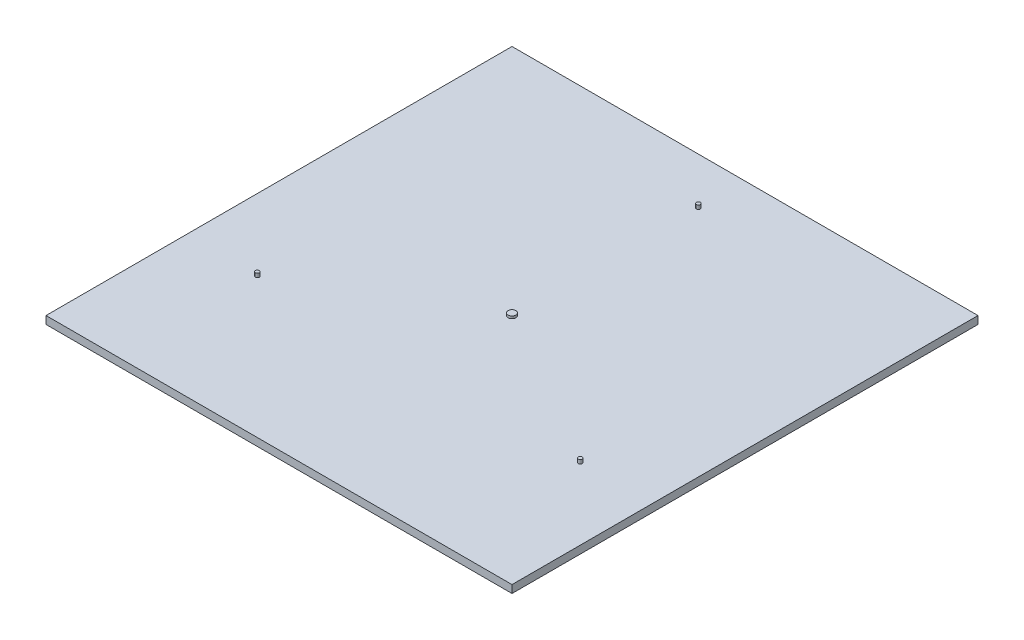
ISO-10303-21;
HEADER;
FILE_DESCRIPTION(('STEP AP214'),'2;1');
FILE_NAME('part.step','',(''),(''),'','','');
FILE_SCHEMA(('AUTOMOTIVE_DESIGN { 1 0 10303 214 1 1 1 1 }'));
ENDSEC;
DATA;
#1=APPLICATION_CONTEXT('core data for automotive mechanical design processes');
#2=APPLICATION_PROTOCOL_DEFINITION('international standard','automotive_design',2000,#1);
#3=PRODUCT_CONTEXT('',#1,'mechanical');
#4=PRODUCT('Part','Part','',(#3));
#5=PRODUCT_RELATED_PRODUCT_CATEGORY('part','',(#4));
#6=PRODUCT_DEFINITION_FORMATION('','',#4);
#7=PRODUCT_DEFINITION_CONTEXT('part definition',#1,'design');
#8=PRODUCT_DEFINITION('design','',#6,#7);
#9=PRODUCT_DEFINITION_SHAPE('','',#8);
#10=(LENGTH_UNIT() NAMED_UNIT(*) SI_UNIT(.MILLI.,.METRE.));
#11=(NAMED_UNIT(*) PLANE_ANGLE_UNIT() SI_UNIT($,.RADIAN.));
#12=(NAMED_UNIT(*) SI_UNIT($,.STERADIAN.) SOLID_ANGLE_UNIT());
#13=UNCERTAINTY_MEASURE_WITH_UNIT(LENGTH_MEASURE(1.E-05),#10,'distance_accuracy_value','');
#14=(GEOMETRIC_REPRESENTATION_CONTEXT(3) GLOBAL_UNCERTAINTY_ASSIGNED_CONTEXT((#13)) GLOBAL_UNIT_ASSIGNED_CONTEXT((#10,
#11,#12)) REPRESENTATION_CONTEXT('',''));
#15=CARTESIAN_POINT('',(0.,0.,0.));
#16=DIRECTION('',(0.,0.,1.));
#17=DIRECTION('',(1.,0.,0.));
#18=AXIS2_PLACEMENT_3D('',#15,#16,#17);
#19=CARTESIAN_POINT('',(-300.,10.,-300.));
#20=DIRECTION('',(1.,0.,0.));
#21=DIRECTION('',(0.,0.,-1.));
#22=AXIS2_PLACEMENT_3D('',#19,#20,#21);
#23=PLANE('',#22);
#24=DIRECTION('',(0.,0.,1.));
#25=VECTOR('',#24,1.);
#26=CARTESIAN_POINT('',(-300.,0.,-300.));
#27=LINE('',#26,#25);
#28=CARTESIAN_POINT('',(-300.,0.,-300.));
#29=VERTEX_POINT('',#28);
#30=CARTESIAN_POINT('',(-300.,0.,300.));
#31=VERTEX_POINT('',#30);
#32=EDGE_CURVE('E107',#29,#31,#27,.T.);
#33=ORIENTED_EDGE('',*,*,#32,.T.);
#34=DIRECTION('',(0.,-1.,0.));
#35=VECTOR('',#34,1.);
#36=CARTESIAN_POINT('',(-300.,10.,300.));
#37=LINE('',#36,#35);
#38=CARTESIAN_POINT('',(-300.,10.,300.));
#39=VERTEX_POINT('',#38);
#40=EDGE_CURVE('E11',#39,#31,#37,.T.);
#41=ORIENTED_EDGE('',*,*,#40,.F.);
#42=DIRECTION('',(0.,0.,1.));
#43=VECTOR('',#42,1.);
#44=CARTESIAN_POINT('',(-300.,10.,-300.));
#45=LINE('',#44,#43);
#46=CARTESIAN_POINT('',(-300.,10.,-300.));
#47=VERTEX_POINT('',#46);
#48=EDGE_CURVE('E91',#47,#39,#45,.T.);
#49=ORIENTED_EDGE('',*,*,#48,.F.);
#50=DIRECTION('',(0.,-1.,0.));
#51=VECTOR('',#50,1.);
#52=CARTESIAN_POINT('',(-300.,10.,-300.));
#53=LINE('',#52,#51);
#54=EDGE_CURVE('E103',#47,#29,#53,.T.);
#55=ORIENTED_EDGE('',*,*,#54,.T.);
#56=EDGE_LOOP('',(#33,#41,#49,#55));
#57=FACE_BOUND('',#56,.T.);
#58=ADVANCED_FACE('F39',(#57),#23,.F.);
#59=CARTESIAN_POINT('',(-300.,10.,300.));
#60=DIRECTION('',(0.,0.,-1.));
#61=DIRECTION('',(-1.,0.,0.));
#62=AXIS2_PLACEMENT_3D('',#59,#60,#61);
#63=PLANE('',#62);
#64=DIRECTION('',(1.,0.,0.));
#65=VECTOR('',#64,1.);
#66=CARTESIAN_POINT('',(-300.,0.,300.));
#67=LINE('',#66,#65);
#68=CARTESIAN_POINT('',(300.,0.,300.));
#69=VERTEX_POINT('',#68);
#70=EDGE_CURVE('E96',#31,#69,#67,.T.);
#71=ORIENTED_EDGE('',*,*,#70,.T.);
#72=DIRECTION('',(0.,-1.,0.));
#73=VECTOR('',#72,1.);
#74=CARTESIAN_POINT('',(300.,10.,300.));
#75=LINE('',#74,#73);
#76=CARTESIAN_POINT('',(300.,10.,300.));
#77=VERTEX_POINT('',#76);
#78=EDGE_CURVE('E48',#77,#69,#75,.T.);
#79=ORIENTED_EDGE('',*,*,#78,.F.);
#80=DIRECTION('',(1.,0.,0.));
#81=VECTOR('',#80,1.);
#82=CARTESIAN_POINT('',(-300.,10.,300.));
#83=LINE('',#82,#81);
#84=EDGE_CURVE('E86',#39,#77,#83,.T.);
#85=ORIENTED_EDGE('',*,*,#84,.F.);
#86=ORIENTED_EDGE('',*,*,#40,.T.);
#87=EDGE_LOOP('',(#71,#79,#85,#86));
#88=FACE_BOUND('',#87,.T.);
#89=ADVANCED_FACE('F95',(#88),#63,.F.);
#90=CARTESIAN_POINT('',(300.,10.,-300.));
#91=DIRECTION('',(-1.,0.,0.));
#92=DIRECTION('',(0.,0.,1.));
#93=AXIS2_PLACEMENT_3D('',#90,#91,#92);
#94=PLANE('',#93);
#95=DIRECTION('',(0.,0.,-1.));
#96=VECTOR('',#95,1.);
#97=CARTESIAN_POINT('',(300.,0.,-300.));
#98=LINE('',#97,#96);
#99=CARTESIAN_POINT('',(300.,0.,-300.));
#100=VERTEX_POINT('',#99);
#101=EDGE_CURVE('E73',#69,#100,#98,.T.);
#102=ORIENTED_EDGE('',*,*,#101,.T.);
#103=DIRECTION('',(0.,-1.,0.));
#104=VECTOR('',#103,1.);
#105=CARTESIAN_POINT('',(300.,10.,-300.));
#106=LINE('',#105,#104);
#107=CARTESIAN_POINT('',(300.,10.,-300.));
#108=VERTEX_POINT('',#107);
#109=EDGE_CURVE('E98',#108,#100,#106,.T.);
#110=ORIENTED_EDGE('',*,*,#109,.F.);
#111=DIRECTION('',(0.,0.,-1.));
#112=VECTOR('',#111,1.);
#113=CARTESIAN_POINT('',(300.,10.,-300.));
#114=LINE('',#113,#112);
#115=EDGE_CURVE('E89',#77,#108,#114,.T.);
#116=ORIENTED_EDGE('',*,*,#115,.F.);
#117=ORIENTED_EDGE('',*,*,#78,.T.);
#118=EDGE_LOOP('',(#102,#110,#116,#117));
#119=FACE_BOUND('',#118,.T.);
#120=ADVANCED_FACE('F99',(#119),#94,.F.);
#121=CARTESIAN_POINT('',(-300.,10.,-300.));
#122=DIRECTION('',(0.,0.,1.));
#123=DIRECTION('',(1.,0.,0.));
#124=AXIS2_PLACEMENT_3D('',#121,#122,#123);
#125=PLANE('',#124);
#126=DIRECTION('',(-1.,0.,0.));
#127=VECTOR('',#126,1.);
#128=CARTESIAN_POINT('',(-300.,0.,-300.));
#129=LINE('',#128,#127);
#130=EDGE_CURVE('E79',#100,#29,#129,.T.);
#131=ORIENTED_EDGE('',*,*,#130,.T.);
#132=ORIENTED_EDGE('',*,*,#54,.F.);
#133=DIRECTION('',(-1.,0.,0.));
#134=VECTOR('',#133,1.);
#135=CARTESIAN_POINT('',(-300.,10.,-300.));
#136=LINE('',#135,#134);
#137=EDGE_CURVE('E56',#108,#47,#136,.T.);
#138=ORIENTED_EDGE('',*,*,#137,.F.);
#139=ORIENTED_EDGE('',*,*,#109,.T.);
#140=EDGE_LOOP('',(#131,#132,#138,#139));
#141=FACE_BOUND('',#140,.T.);
#142=ADVANCED_FACE('F121',(#141),#125,.F.);
#143=CARTESIAN_POINT('',(0.,10.,0.));
#144=DIRECTION('',(0.,1.,0.));
#145=DIRECTION('',(0.,0.,1.));
#146=AXIS2_PLACEMENT_3D('',#143,#144,#145);
#147=PLANE('',#146);
#148=CARTESIAN_POINT('',(0.,10.,0.));
#149=DIRECTION('',(0.,1.,0.));
#150=DIRECTION('',(0.,0.,1.));
#151=AXIS2_PLACEMENT_3D('',#148,#149,#150);
#152=CIRCLE('',#151,5.);
#153=CARTESIAN_POINT('',(0.,10.,5.));
#154=VERTEX_POINT('',#153);
#155=EDGE_CURVE('E152',#154,#154,#152,.T.);
#156=ORIENTED_EDGE('',*,*,#155,.F.);
#157=EDGE_LOOP('',(#156));
#158=FACE_BOUND('',#157,.T.);
#159=CARTESIAN_POINT('',(-207.846096908265,10.,120.000000000001));
#160=DIRECTION('',(0.,1.,0.));
#161=DIRECTION('',(0.,0.,1.));
#162=AXIS2_PLACEMENT_3D('',#159,#160,#161);
#163=CIRCLE('',#162,2.5);
#164=CARTESIAN_POINT('',(-207.846096908265,10.,122.500000000001));
#165=VERTEX_POINT('',#164);
#166=EDGE_CURVE('E144',#165,#165,#163,.T.);
#167=ORIENTED_EDGE('',*,*,#166,.F.);
#168=EDGE_LOOP('',(#167));
#169=FACE_BOUND('',#168,.T.);
#170=CARTESIAN_POINT('',(207.846096908266,10.,119.999999999998));
#171=DIRECTION('',(0.,1.,0.));
#172=DIRECTION('',(0.,0.,1.));
#173=AXIS2_PLACEMENT_3D('',#170,#171,#172);
#174=CIRCLE('',#173,2.50000000000005);
#175=CARTESIAN_POINT('',(207.846096908266,10.,122.499999999998));
#176=VERTEX_POINT('',#175);
#177=EDGE_CURVE('E136',#176,#176,#174,.T.);
#178=ORIENTED_EDGE('',*,*,#177,.F.);
#179=EDGE_LOOP('',(#178));
#180=FACE_BOUND('',#179,.T.);
#181=CARTESIAN_POINT('',(0.,10.,-240.));
#182=DIRECTION('',(0.,1.,0.));
#183=DIRECTION('',(0.,0.,1.));
#184=AXIS2_PLACEMENT_3D('',#181,#182,#183);
#185=CIRCLE('',#184,2.5);
#186=CARTESIAN_POINT('',(0.,10.,-237.5));
#187=VERTEX_POINT('',#186);
#188=EDGE_CURVE('E128',#187,#187,#185,.T.);
#189=ORIENTED_EDGE('',*,*,#188,.F.);
#190=EDGE_LOOP('',(#189));
#191=FACE_BOUND('',#190,.T.);
#192=ORIENTED_EDGE('',*,*,#48,.T.);
#193=ORIENTED_EDGE('',*,*,#84,.T.);
#194=ORIENTED_EDGE('',*,*,#115,.T.);
#195=ORIENTED_EDGE('',*,*,#137,.T.);
#196=EDGE_LOOP('',(#192,#193,#194,#195));
#197=FACE_BOUND('',#196,.T.);
#198=ADVANCED_FACE('F87',(#158,#169,#180,#191,#197),#147,.T.);
#199=CARTESIAN_POINT('',(0.,0.,0.));
#200=DIRECTION('',(0.,1.,0.));
#201=DIRECTION('',(0.,0.,1.));
#202=AXIS2_PLACEMENT_3D('',#199,#200,#201);
#203=PLANE('',#202);
#204=ORIENTED_EDGE('',*,*,#32,.F.);
#205=ORIENTED_EDGE('',*,*,#130,.F.);
#206=ORIENTED_EDGE('',*,*,#101,.F.);
#207=ORIENTED_EDGE('',*,*,#70,.F.);
#208=EDGE_LOOP('',(#204,#205,#206,#207));
#209=FACE_BOUND('',#208,.T.);
#210=ADVANCED_FACE('F124',(#209),#203,.F.);
#211=CARTESIAN_POINT('',(0.,15.,-240.));
#212=DIRECTION('',(0.,-1.,0.));
#213=DIRECTION('',(0.,0.,-1.));
#214=AXIS2_PLACEMENT_3D('',#211,#212,#213);
#215=CYLINDRICAL_SURFACE('',#214,2.5);
#216=CARTESIAN_POINT('',(0.,15.,-240.));
#217=DIRECTION('',(0.,1.,0.));
#218=DIRECTION('',(0.,0.,1.));
#219=AXIS2_PLACEMENT_3D('',#216,#217,#218);
#220=CIRCLE('',#219,2.5);
#221=CARTESIAN_POINT('',(0.,15.,-237.5));
#222=VERTEX_POINT('',#221);
#223=EDGE_CURVE('E111',#222,#222,#220,.T.);
#224=ORIENTED_EDGE('',*,*,#223,.F.);
#225=EDGE_LOOP('',(#224));
#226=FACE_BOUND('',#225,.T.);
#227=ORIENTED_EDGE('',*,*,#188,.T.);
#228=EDGE_LOOP('',(#227));
#229=FACE_BOUND('',#228,.T.);
#230=ADVANCED_FACE('F178',(#226,#229),#215,.T.);
#231=CARTESIAN_POINT('',(0.,15.,-240.));
#232=DIRECTION('',(0.,1.,0.));
#233=DIRECTION('',(0.,0.,1.));
#234=AXIS2_PLACEMENT_3D('',#231,#232,#233);
#235=PLANE('',#234);
#236=ORIENTED_EDGE('',*,*,#223,.T.);
#237=EDGE_LOOP('',(#236));
#238=FACE_BOUND('',#237,.T.);
#239=ADVANCED_FACE('F180',(#238),#235,.T.);
#240=CARTESIAN_POINT('',(207.846096908266,15.,119.999999999998));
#241=DIRECTION('',(0.,-1.,0.));
#242=DIRECTION('',(0.,0.,-1.));
#243=AXIS2_PLACEMENT_3D('',#240,#241,#242);
#244=CYLINDRICAL_SURFACE('',#243,2.50000000000005);
#245=CARTESIAN_POINT('',(207.846096908266,15.,119.999999999998));
#246=DIRECTION('',(0.,1.,0.));
#247=DIRECTION('',(0.,0.,1.));
#248=AXIS2_PLACEMENT_3D('',#245,#246,#247);
#249=CIRCLE('',#248,2.50000000000005);
#250=CARTESIAN_POINT('',(207.846096908266,15.,122.499999999998));
#251=VERTEX_POINT('',#250);
#252=EDGE_CURVE('E132',#251,#251,#249,.T.);
#253=ORIENTED_EDGE('',*,*,#252,.F.);
#254=EDGE_LOOP('',(#253));
#255=FACE_BOUND('',#254,.T.);
#256=ORIENTED_EDGE('',*,*,#177,.T.);
#257=EDGE_LOOP('',(#256));
#258=FACE_BOUND('',#257,.T.);
#259=ADVANCED_FACE('F187',(#255,#258),#244,.T.);
#260=CARTESIAN_POINT('',(207.846096908266,15.,119.999999999998));
#261=DIRECTION('',(0.,1.,0.));
#262=DIRECTION('',(0.,0.,1.));
#263=AXIS2_PLACEMENT_3D('',#260,#261,#262);
#264=PLANE('',#263);
#265=ORIENTED_EDGE('',*,*,#252,.T.);
#266=EDGE_LOOP('',(#265));
#267=FACE_BOUND('',#266,.T.);
#268=ADVANCED_FACE('F235',(#267),#264,.T.);
#269=CARTESIAN_POINT('',(-207.846096908265,15.,120.000000000001));
#270=DIRECTION('',(0.,-1.,0.));
#271=DIRECTION('',(0.,0.,-1.));
#272=AXIS2_PLACEMENT_3D('',#269,#270,#271);
#273=CYLINDRICAL_SURFACE('',#272,2.5);
#274=CARTESIAN_POINT('',(-207.846096908265,15.,120.000000000001));
#275=DIRECTION('',(0.,1.,0.));
#276=DIRECTION('',(0.,0.,1.));
#277=AXIS2_PLACEMENT_3D('',#274,#275,#276);
#278=CIRCLE('',#277,2.5);
#279=CARTESIAN_POINT('',(-207.846096908265,15.,122.500000000001));
#280=VERTEX_POINT('',#279);
#281=EDGE_CURVE('E140',#280,#280,#278,.T.);
#282=ORIENTED_EDGE('',*,*,#281,.F.);
#283=EDGE_LOOP('',(#282));
#284=FACE_BOUND('',#283,.T.);
#285=ORIENTED_EDGE('',*,*,#166,.T.);
#286=EDGE_LOOP('',(#285));
#287=FACE_BOUND('',#286,.T.);
#288=ADVANCED_FACE('F245',(#284,#287),#273,.T.);
#289=CARTESIAN_POINT('',(-207.846096908265,15.,120.000000000001));
#290=DIRECTION('',(0.,1.,0.));
#291=DIRECTION('',(0.,0.,1.));
#292=AXIS2_PLACEMENT_3D('',#289,#290,#291);
#293=PLANE('',#292);
#294=ORIENTED_EDGE('',*,*,#281,.T.);
#295=EDGE_LOOP('',(#294));
#296=FACE_BOUND('',#295,.T.);
#297=ADVANCED_FACE('F165',(#296),#293,.T.);
#298=CARTESIAN_POINT('',(0.,13.,0.));
#299=DIRECTION('',(0.,-1.,0.));
#300=DIRECTION('',(0.,0.,-1.));
#301=AXIS2_PLACEMENT_3D('',#298,#299,#300);
#302=CYLINDRICAL_SURFACE('',#301,5.);
#303=CARTESIAN_POINT('',(0.,13.,0.));
#304=DIRECTION('',(0.,1.,0.));
#305=DIRECTION('',(0.,0.,1.));
#306=AXIS2_PLACEMENT_3D('',#303,#304,#305);
#307=CIRCLE('',#306,5.);
#308=CARTESIAN_POINT('',(0.,13.,5.));
#309=VERTEX_POINT('',#308);
#310=EDGE_CURVE('E148',#309,#309,#307,.T.);
#311=ORIENTED_EDGE('',*,*,#310,.F.);
#312=EDGE_LOOP('',(#311));
#313=FACE_BOUND('',#312,.T.);
#314=ORIENTED_EDGE('',*,*,#155,.T.);
#315=EDGE_LOOP('',(#314));
#316=FACE_BOUND('',#315,.T.);
#317=ADVANCED_FACE('F162',(#313,#316),#302,.T.);
#318=CARTESIAN_POINT('',(0.,13.,0.));
#319=DIRECTION('',(0.,1.,0.));
#320=DIRECTION('',(0.,0.,1.));
#321=AXIS2_PLACEMENT_3D('',#318,#319,#320);
#322=PLANE('',#321);
#323=ORIENTED_EDGE('',*,*,#310,.T.);
#324=EDGE_LOOP('',(#323));
#325=FACE_BOUND('',#324,.T.);
#326=ADVANCED_FACE('F160',(#325),#322,.T.);
#327=CLOSED_SHELL('',(#58,#89,#120,#142,#198,#210,#230,#239,#259,#268,#288,#297,#317,#326));
#328=MANIFOLD_SOLID_BREP('B2',#327);
#329=ADVANCED_BREP_SHAPE_REPRESENTATION('',(#18,#328),#14);
#330=SHAPE_DEFINITION_REPRESENTATION(#9,#329);
ENDSEC;
END-ISO-10303-21;
